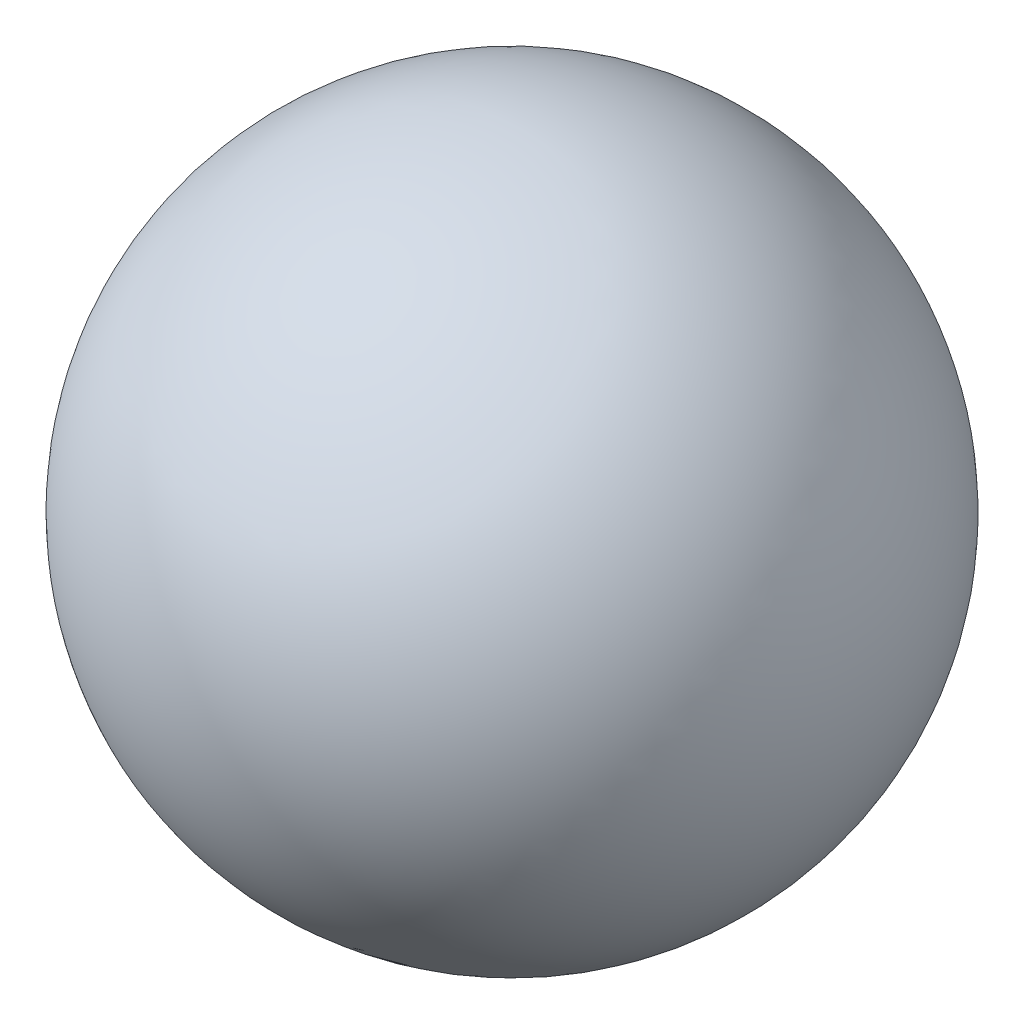
ISO-10303-21;
HEADER;
FILE_DESCRIPTION(('STEP AP214'),'2;1');
FILE_NAME('part.step','',(''),(''),'','','');
FILE_SCHEMA(('AUTOMOTIVE_DESIGN { 1 0 10303 214 1 1 1 1 }'));
ENDSEC;
DATA;
#1=APPLICATION_CONTEXT('core data for automotive mechanical design processes');
#2=APPLICATION_PROTOCOL_DEFINITION('international standard','automotive_design',2000,#1);
#3=PRODUCT_CONTEXT('',#1,'mechanical');
#4=PRODUCT('Part','Part','',(#3));
#5=PRODUCT_RELATED_PRODUCT_CATEGORY('part','',(#4));
#6=PRODUCT_DEFINITION_FORMATION('','',#4);
#7=PRODUCT_DEFINITION_CONTEXT('part definition',#1,'design');
#8=PRODUCT_DEFINITION('design','',#6,#7);
#9=PRODUCT_DEFINITION_SHAPE('','',#8);
#10=(LENGTH_UNIT() NAMED_UNIT(*) SI_UNIT(.MILLI.,.METRE.));
#11=(NAMED_UNIT(*) PLANE_ANGLE_UNIT() SI_UNIT($,.RADIAN.));
#12=(NAMED_UNIT(*) SI_UNIT($,.STERADIAN.) SOLID_ANGLE_UNIT());
#13=UNCERTAINTY_MEASURE_WITH_UNIT(LENGTH_MEASURE(1.E-05),#10,'distance_accuracy_value','');
#14=(GEOMETRIC_REPRESENTATION_CONTEXT(3) GLOBAL_UNCERTAINTY_ASSIGNED_CONTEXT((#13)) GLOBAL_UNIT_ASSIGNED_CONTEXT((#10,
#11,#12)) REPRESENTATION_CONTEXT('',''));
#15=CARTESIAN_POINT('',(0.,0.,0.));
#16=DIRECTION('',(0.,0.,1.));
#17=DIRECTION('',(1.,0.,0.));
#18=AXIS2_PLACEMENT_3D('',#15,#16,#17);
#19=CARTESIAN_POINT('',(49.75,6.75829527711397,52.5668378847096));
#20=DIRECTION('',(0.,0.127516208211662,0.99183648684817));
#21=DIRECTION('',(0.173648177666933,-0.976768261968468,0.125578950481564));
#22=AXIS2_PLACEMENT_3D('',#19,#20,#21);
#23=SPHERICAL_SURFACE('',#22,5.95);
#24=CARTESIAN_POINT('',(49.75,7.51701671597336,58.4682649814562));
#25=VERTEX_POINT('',#24);
#26=VERTEX_LOOP('',#25);
#27=FACE_BOUND('',#26,.T.);
#28=CARTESIAN_POINT('',(49.75,5.99957383825458,46.665410787963));
#29=VERTEX_POINT('',#28);
#30=VERTEX_LOOP('',#29);
#31=FACE_BOUND('',#30,.T.);
#32=ADVANCED_FACE('F16',(#27,#31),#23,.T.);
#33=CLOSED_SHELL('',(#32));
#34=MANIFOLD_SOLID_BREP('B1',#33);
#35=ADVANCED_BREP_SHAPE_REPRESENTATION('',(#18,#34),#14);
#36=SHAPE_DEFINITION_REPRESENTATION(#9,#35);
ENDSEC;
END-ISO-10303-21;
